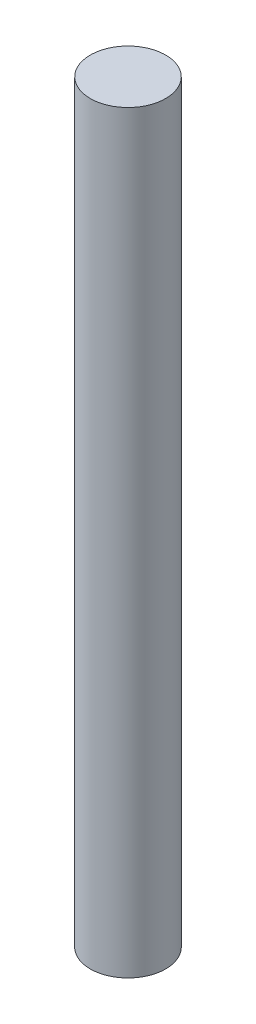
ISO-10303-21;
HEADER;
FILE_DESCRIPTION(('STEP AP214'),'2;1');
FILE_NAME('part.step','',(''),(''),'','','');
FILE_SCHEMA(('AUTOMOTIVE_DESIGN { 1 0 10303 214 1 1 1 1 }'));
ENDSEC;
DATA;
#1=APPLICATION_CONTEXT('core data for automotive mechanical design processes');
#2=APPLICATION_PROTOCOL_DEFINITION('international standard','automotive_design',2000,#1);
#3=PRODUCT_CONTEXT('',#1,'mechanical');
#4=PRODUCT('Part','Part','',(#3));
#5=PRODUCT_RELATED_PRODUCT_CATEGORY('part','',(#4));
#6=PRODUCT_DEFINITION_FORMATION('','',#4);
#7=PRODUCT_DEFINITION_CONTEXT('part definition',#1,'design');
#8=PRODUCT_DEFINITION('design','',#6,#7);
#9=PRODUCT_DEFINITION_SHAPE('','',#8);
#10=(LENGTH_UNIT() NAMED_UNIT(*) SI_UNIT(.MILLI.,.METRE.));
#11=(NAMED_UNIT(*) PLANE_ANGLE_UNIT() SI_UNIT($,.RADIAN.));
#12=(NAMED_UNIT(*) SI_UNIT($,.STERADIAN.) SOLID_ANGLE_UNIT());
#13=UNCERTAINTY_MEASURE_WITH_UNIT(LENGTH_MEASURE(1.E-05),#10,'distance_accuracy_value','');
#14=(GEOMETRIC_REPRESENTATION_CONTEXT(3) GLOBAL_UNCERTAINTY_ASSIGNED_CONTEXT((#13)) GLOBAL_UNIT_ASSIGNED_CONTEXT((#10,
#11,#12)) REPRESENTATION_CONTEXT('',''));
#15=CARTESIAN_POINT('',(0.,0.,0.));
#16=DIRECTION('',(0.,0.,1.));
#17=DIRECTION('',(1.,0.,0.));
#18=AXIS2_PLACEMENT_3D('',#15,#16,#17);
#19=CARTESIAN_POINT('',(0.,30.,0.));
#20=DIRECTION('',(0.,-1.,0.));
#21=DIRECTION('',(0.,0.,-1.));
#22=AXIS2_PLACEMENT_3D('',#19,#20,#21);
#23=CYLINDRICAL_SURFACE('',#22,1.5);
#24=CARTESIAN_POINT('',(0.,30.,0.));
#25=DIRECTION('',(0.,1.,0.));
#26=DIRECTION('',(0.,0.,1.));
#27=AXIS2_PLACEMENT_3D('',#24,#25,#26);
#28=CIRCLE('',#27,1.5);
#29=CARTESIAN_POINT('',(0.,30.,1.5));
#30=VERTEX_POINT('',#29);
#31=EDGE_CURVE('E10',#30,#30,#28,.T.);
#32=ORIENTED_EDGE('',*,*,#31,.F.);
#33=EDGE_LOOP('',(#32));
#34=FACE_BOUND('',#33,.T.);
#35=CARTESIAN_POINT('',(0.,0.,0.));
#36=DIRECTION('',(0.,1.,0.));
#37=DIRECTION('',(0.,0.,1.));
#38=AXIS2_PLACEMENT_3D('',#35,#36,#37);
#39=CIRCLE('',#38,1.5);
#40=CARTESIAN_POINT('',(0.,0.,1.5));
#41=VERTEX_POINT('',#40);
#42=EDGE_CURVE('E40',#41,#41,#39,.T.);
#43=ORIENTED_EDGE('',*,*,#42,.T.);
#44=EDGE_LOOP('',(#43));
#45=FACE_BOUND('',#44,.T.);
#46=ADVANCED_FACE('F37',(#34,#45),#23,.T.);
#47=CARTESIAN_POINT('',(0.,30.,0.));
#48=DIRECTION('',(0.,1.,0.));
#49=DIRECTION('',(0.,0.,1.));
#50=AXIS2_PLACEMENT_3D('',#47,#48,#49);
#51=PLANE('',#50);
#52=ORIENTED_EDGE('',*,*,#31,.T.);
#53=EDGE_LOOP('',(#52));
#54=FACE_BOUND('',#53,.T.);
#55=ADVANCED_FACE('F54',(#54),#51,.T.);
#56=CARTESIAN_POINT('',(0.,0.,0.));
#57=DIRECTION('',(0.,1.,0.));
#58=DIRECTION('',(0.,0.,1.));
#59=AXIS2_PLACEMENT_3D('',#56,#57,#58);
#60=PLANE('',#59);
#61=ORIENTED_EDGE('',*,*,#42,.F.);
#62=EDGE_LOOP('',(#61));
#63=FACE_BOUND('',#62,.T.);
#64=ADVANCED_FACE('F52',(#63),#60,.F.);
#65=CLOSED_SHELL('',(#46,#55,#64));
#66=MANIFOLD_SOLID_BREP('B2',#65);
#67=ADVANCED_BREP_SHAPE_REPRESENTATION('',(#18,#66),#14);
#68=SHAPE_DEFINITION_REPRESENTATION(#9,#67);
ENDSEC;
END-ISO-10303-21;
